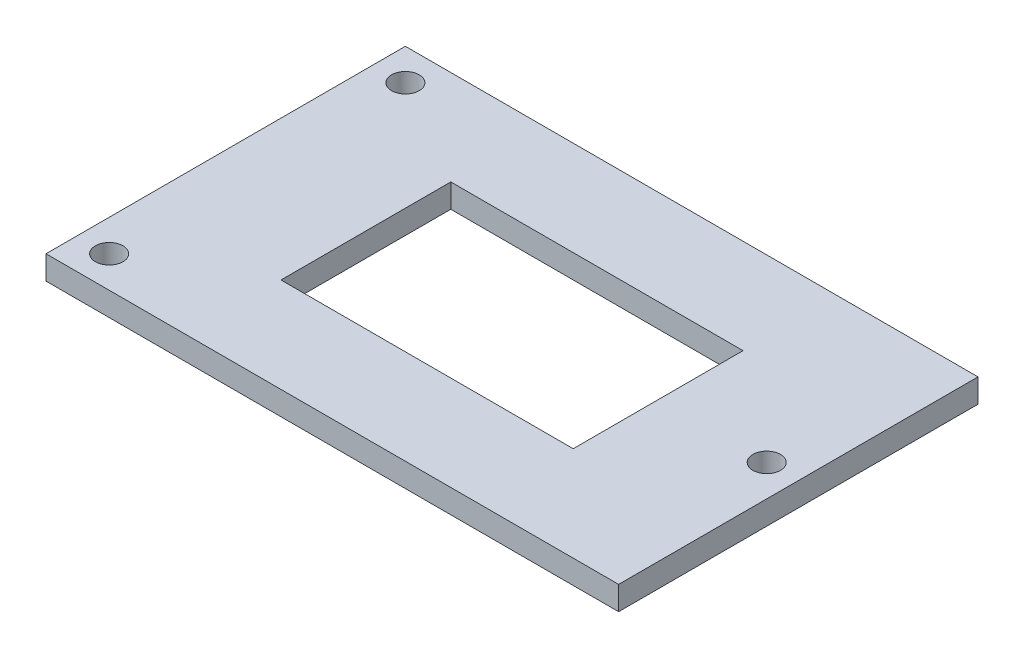
ISO-10303-21;
HEADER;
FILE_DESCRIPTION(('STEP AP214'),'2;1');
FILE_NAME('part.step','',(''),(''),'','','');
FILE_SCHEMA(('AUTOMOTIVE_DESIGN { 1 0 10303 214 1 1 1 1 }'));
ENDSEC;
DATA;
#1=APPLICATION_CONTEXT('core data for automotive mechanical design processes');
#2=APPLICATION_PROTOCOL_DEFINITION('international standard','automotive_design',2000,#1);
#3=PRODUCT_CONTEXT('',#1,'mechanical');
#4=PRODUCT('Part','Part','',(#3));
#5=PRODUCT_RELATED_PRODUCT_CATEGORY('part','',(#4));
#6=PRODUCT_DEFINITION_FORMATION('','',#4);
#7=PRODUCT_DEFINITION_CONTEXT('part definition',#1,'design');
#8=PRODUCT_DEFINITION('design','',#6,#7);
#9=PRODUCT_DEFINITION_SHAPE('','',#8);
#10=(LENGTH_UNIT() NAMED_UNIT(*) SI_UNIT(.MILLI.,.METRE.));
#11=(NAMED_UNIT(*) PLANE_ANGLE_UNIT() SI_UNIT($,.RADIAN.));
#12=(NAMED_UNIT(*) SI_UNIT($,.STERADIAN.) SOLID_ANGLE_UNIT());
#13=UNCERTAINTY_MEASURE_WITH_UNIT(LENGTH_MEASURE(1.E-05),#10,'distance_accuracy_value','');
#14=(GEOMETRIC_REPRESENTATION_CONTEXT(3) GLOBAL_UNCERTAINTY_ASSIGNED_CONTEXT((#13)) GLOBAL_UNIT_ASSIGNED_CONTEXT((#10,
#11,#12)) REPRESENTATION_CONTEXT('',''));
#15=CARTESIAN_POINT('',(0.,0.,0.));
#16=DIRECTION('',(0.,0.,1.));
#17=DIRECTION('',(1.,0.,0.));
#18=AXIS2_PLACEMENT_3D('',#15,#16,#17);
#19=CARTESIAN_POINT('',(0.,3.,0.));
#20=DIRECTION('',(0.,-1.,0.));
#21=DIRECTION('',(0.,0.,-1.));
#22=AXIS2_PLACEMENT_3D('',#19,#20,#21);
#23=PLANE('',#22);
#24=DIRECTION('',(0.,0.,1.));
#25=VECTOR('',#24,1.);
#26=CARTESIAN_POINT('',(0.,3.,0.));
#27=LINE('',#26,#25);
#28=CARTESIAN_POINT('',(0.,3.,-45.5));
#29=VERTEX_POINT('',#28);
#30=CARTESIAN_POINT('',(0.,3.,0.));
#31=VERTEX_POINT('',#30);
#32=EDGE_CURVE('E142',#29,#31,#27,.T.);
#33=ORIENTED_EDGE('',*,*,#32,.T.);
#34=DIRECTION('',(1.,0.,0.));
#35=VECTOR('',#34,1.);
#36=CARTESIAN_POINT('',(0.,3.,0.));
#37=LINE('',#36,#35);
#38=CARTESIAN_POINT('',(72.5,3.,0.));
#39=VERTEX_POINT('',#38);
#40=EDGE_CURVE('E145',#31,#39,#37,.T.);
#41=ORIENTED_EDGE('',*,*,#40,.T.);
#42=DIRECTION('',(0.,0.,-1.));
#43=VECTOR('',#42,1.);
#44=CARTESIAN_POINT('',(72.5,3.,0.));
#45=LINE('',#44,#43);
#46=CARTESIAN_POINT('',(72.5,3.,-45.5));
#47=VERTEX_POINT('',#46);
#48=EDGE_CURVE('E148',#39,#47,#45,.T.);
#49=ORIENTED_EDGE('',*,*,#48,.T.);
#50=DIRECTION('',(-1.,0.,0.));
#51=VECTOR('',#50,1.);
#52=CARTESIAN_POINT('',(0.,3.,-45.5));
#53=LINE('',#52,#51);
#54=EDGE_CURVE('E150',#47,#29,#53,.T.);
#55=ORIENTED_EDGE('',*,*,#54,.T.);
#56=EDGE_LOOP('',(#33,#41,#49,#55));
#57=FACE_BOUND('',#56,.T.);
#58=DIRECTION('',(0.,0.,1.));
#59=VECTOR('',#58,1.);
#60=CARTESIAN_POINT('',(17.75,3.,-12.));
#61=LINE('',#60,#59);
#62=CARTESIAN_POINT('',(17.75,3.,-33.5));
#63=VERTEX_POINT('',#62);
#64=CARTESIAN_POINT('',(17.75,3.,-12.));
#65=VERTEX_POINT('',#64);
#66=EDGE_CURVE('E103',#63,#65,#61,.T.);
#67=ORIENTED_EDGE('',*,*,#66,.F.);
#68=DIRECTION('',(-1.,0.,0.));
#69=VECTOR('',#68,1.);
#70=CARTESIAN_POINT('',(17.75,3.,-33.5));
#71=LINE('',#70,#69);
#72=CARTESIAN_POINT('',(54.75,3.,-33.5));
#73=VERTEX_POINT('',#72);
#74=EDGE_CURVE('E126',#73,#63,#71,.T.);
#75=ORIENTED_EDGE('',*,*,#74,.F.);
#76=DIRECTION('',(0.,0.,-1.));
#77=VECTOR('',#76,1.);
#78=CARTESIAN_POINT('',(54.75,3.,-12.));
#79=LINE('',#78,#77);
#80=CARTESIAN_POINT('',(54.75,3.,-12.));
#81=VERTEX_POINT('',#80);
#82=EDGE_CURVE('E124',#81,#73,#79,.T.);
#83=ORIENTED_EDGE('',*,*,#82,.F.);
#84=DIRECTION('',(1.,0.,0.));
#85=VECTOR('',#84,1.);
#86=CARTESIAN_POINT('',(17.75,3.,-12.));
#87=LINE('',#86,#85);
#88=EDGE_CURVE('E111',#65,#81,#87,.T.);
#89=ORIENTED_EDGE('',*,*,#88,.F.);
#90=EDGE_LOOP('',(#67,#75,#83,#89));
#91=FACE_BOUND('',#90,.T.);
#92=CARTESIAN_POINT('',(68.5,3.,-22.75));
#93=DIRECTION('',(0.,1.,0.));
#94=DIRECTION('',(0.,0.,1.));
#95=AXIS2_PLACEMENT_3D('',#92,#93,#94);
#96=CIRCLE('',#95,1.75);
#97=CARTESIAN_POINT('',(68.5,3.,-21.));
#98=VERTEX_POINT('',#97);
#99=EDGE_CURVE('E132',#98,#98,#96,.T.);
#100=ORIENTED_EDGE('',*,*,#99,.F.);
#101=EDGE_LOOP('',(#100));
#102=FACE_BOUND('',#101,.T.);
#103=CARTESIAN_POINT('',(4.,3.,-41.5));
#104=DIRECTION('',(0.,1.,0.));
#105=DIRECTION('',(0.,0.,1.));
#106=AXIS2_PLACEMENT_3D('',#103,#104,#105);
#107=CIRCLE('',#106,1.75);
#108=CARTESIAN_POINT('',(4.,3.,-39.75));
#109=VERTEX_POINT('',#108);
#110=EDGE_CURVE('E244',#109,#109,#107,.T.);
#111=ORIENTED_EDGE('',*,*,#110,.F.);
#112=EDGE_LOOP('',(#111));
#113=FACE_BOUND('',#112,.T.);
#114=CARTESIAN_POINT('',(4.,3.,-4.));
#115=DIRECTION('',(0.,1.,0.));
#116=DIRECTION('',(0.,0.,1.));
#117=AXIS2_PLACEMENT_3D('',#114,#115,#116);
#118=CIRCLE('',#117,1.75);
#119=CARTESIAN_POINT('',(4.,3.,-2.25));
#120=VERTEX_POINT('',#119);
#121=EDGE_CURVE('E235',#120,#120,#118,.T.);
#122=ORIENTED_EDGE('',*,*,#121,.F.);
#123=EDGE_LOOP('',(#122));
#124=FACE_BOUND('',#123,.T.);
#125=ADVANCED_FACE('F38',(#57,#91,#102,#113,#124),#23,.F.);
#126=CARTESIAN_POINT('',(0.,0.,0.));
#127=DIRECTION('',(0.,-1.,0.));
#128=DIRECTION('',(0.,0.,-1.));
#129=AXIS2_PLACEMENT_3D('',#126,#127,#128);
#130=PLANE('',#129);
#131=CARTESIAN_POINT('',(4.,0.,-41.5));
#132=DIRECTION('',(0.,1.,0.));
#133=DIRECTION('',(0.,0.,1.));
#134=AXIS2_PLACEMENT_3D('',#131,#132,#133);
#135=CIRCLE('',#134,1.75);
#136=CARTESIAN_POINT('',(4.,0.,-39.75));
#137=VERTEX_POINT('',#136);
#138=EDGE_CURVE('E241',#137,#137,#135,.T.);
#139=ORIENTED_EDGE('',*,*,#138,.T.);
#140=EDGE_LOOP('',(#139));
#141=FACE_BOUND('',#140,.T.);
#142=DIRECTION('',(-1.,0.,0.));
#143=VECTOR('',#142,1.);
#144=CARTESIAN_POINT('',(17.75,0.,-33.5));
#145=LINE('',#144,#143);
#146=CARTESIAN_POINT('',(54.75,0.,-33.5));
#147=VERTEX_POINT('',#146);
#148=CARTESIAN_POINT('',(17.75,0.,-33.5));
#149=VERTEX_POINT('',#148);
#150=EDGE_CURVE('E112',#147,#149,#145,.T.);
#151=ORIENTED_EDGE('',*,*,#150,.T.);
#152=DIRECTION('',(0.,0.,1.));
#153=VECTOR('',#152,1.);
#154=CARTESIAN_POINT('',(17.75,0.,-12.));
#155=LINE('',#154,#153);
#156=CARTESIAN_POINT('',(17.75,0.,-12.));
#157=VERTEX_POINT('',#156);
#158=EDGE_CURVE('E61',#149,#157,#155,.T.);
#159=ORIENTED_EDGE('',*,*,#158,.T.);
#160=DIRECTION('',(1.,0.,0.));
#161=VECTOR('',#160,1.);
#162=CARTESIAN_POINT('',(17.75,0.,-12.));
#163=LINE('',#162,#161);
#164=CARTESIAN_POINT('',(54.75,0.,-12.));
#165=VERTEX_POINT('',#164);
#166=EDGE_CURVE('E118',#157,#165,#163,.T.);
#167=ORIENTED_EDGE('',*,*,#166,.T.);
#168=DIRECTION('',(0.,0.,-1.));
#169=VECTOR('',#168,1.);
#170=CARTESIAN_POINT('',(54.75,0.,-12.));
#171=LINE('',#170,#169);
#172=EDGE_CURVE('E134',#165,#147,#171,.T.);
#173=ORIENTED_EDGE('',*,*,#172,.T.);
#174=EDGE_LOOP('',(#151,#159,#167,#173));
#175=FACE_BOUND('',#174,.T.);
#176=DIRECTION('',(0.,0.,1.));
#177=VECTOR('',#176,1.);
#178=CARTESIAN_POINT('',(0.,0.,0.));
#179=LINE('',#178,#177);
#180=CARTESIAN_POINT('',(0.,0.,-45.5));
#181=VERTEX_POINT('',#180);
#182=CARTESIAN_POINT('',(0.,0.,0.));
#183=VERTEX_POINT('',#182);
#184=EDGE_CURVE('E119',#181,#183,#179,.T.);
#185=ORIENTED_EDGE('',*,*,#184,.F.);
#186=DIRECTION('',(-1.,0.,0.));
#187=VECTOR('',#186,1.);
#188=CARTESIAN_POINT('',(0.,0.,-45.5));
#189=LINE('',#188,#187);
#190=CARTESIAN_POINT('',(72.5,0.,-45.5));
#191=VERTEX_POINT('',#190);
#192=EDGE_CURVE('E146',#191,#181,#189,.T.);
#193=ORIENTED_EDGE('',*,*,#192,.F.);
#194=DIRECTION('',(0.,0.,-1.));
#195=VECTOR('',#194,1.);
#196=CARTESIAN_POINT('',(72.5,0.,0.));
#197=LINE('',#196,#195);
#198=CARTESIAN_POINT('',(72.5,0.,0.));
#199=VERTEX_POINT('',#198);
#200=EDGE_CURVE('E157',#199,#191,#197,.T.);
#201=ORIENTED_EDGE('',*,*,#200,.F.);
#202=DIRECTION('',(1.,0.,0.));
#203=VECTOR('',#202,1.);
#204=CARTESIAN_POINT('',(0.,0.,0.));
#205=LINE('',#204,#203);
#206=EDGE_CURVE('E155',#183,#199,#205,.T.);
#207=ORIENTED_EDGE('',*,*,#206,.F.);
#208=EDGE_LOOP('',(#185,#193,#201,#207));
#209=FACE_BOUND('',#208,.T.);
#210=CARTESIAN_POINT('',(68.5,0.,-22.75));
#211=DIRECTION('',(0.,1.,0.));
#212=DIRECTION('',(0.,0.,1.));
#213=AXIS2_PLACEMENT_3D('',#210,#211,#212);
#214=CIRCLE('',#213,1.75);
#215=CARTESIAN_POINT('',(68.5,0.,-21.));
#216=VERTEX_POINT('',#215);
#217=EDGE_CURVE('E247',#216,#216,#214,.T.);
#218=ORIENTED_EDGE('',*,*,#217,.T.);
#219=EDGE_LOOP('',(#218));
#220=FACE_BOUND('',#219,.T.);
#221=CARTESIAN_POINT('',(4.,0.,-4.));
#222=DIRECTION('',(0.,1.,0.));
#223=DIRECTION('',(0.,0.,1.));
#224=AXIS2_PLACEMENT_3D('',#221,#222,#223);
#225=CIRCLE('',#224,1.75);
#226=CARTESIAN_POINT('',(4.,0.,-2.25));
#227=VERTEX_POINT('',#226);
#228=EDGE_CURVE('E238',#227,#227,#225,.T.);
#229=ORIENTED_EDGE('',*,*,#228,.T.);
#230=EDGE_LOOP('',(#229));
#231=FACE_BOUND('',#230,.T.);
#232=ADVANCED_FACE('F175',(#141,#175,#209,#220,#231),#130,.T.);
#233=CARTESIAN_POINT('',(0.,3.,0.));
#234=DIRECTION('',(1.,0.,0.));
#235=DIRECTION('',(0.,0.,-1.));
#236=AXIS2_PLACEMENT_3D('',#233,#234,#235);
#237=PLANE('',#236);
#238=ORIENTED_EDGE('',*,*,#184,.T.);
#239=DIRECTION('',(0.,-1.,0.));
#240=VECTOR('',#239,1.);
#241=CARTESIAN_POINT('',(0.,3.,0.));
#242=LINE('',#241,#240);
#243=EDGE_CURVE('E11',#31,#183,#242,.T.);
#244=ORIENTED_EDGE('',*,*,#243,.F.);
#245=ORIENTED_EDGE('',*,*,#32,.F.);
#246=DIRECTION('',(0.,-1.,0.));
#247=VECTOR('',#246,1.);
#248=CARTESIAN_POINT('',(0.,3.,-45.5));
#249=LINE('',#248,#247);
#250=EDGE_CURVE('E152',#29,#181,#249,.T.);
#251=ORIENTED_EDGE('',*,*,#250,.T.);
#252=EDGE_LOOP('',(#238,#244,#245,#251));
#253=FACE_BOUND('',#252,.T.);
#254=ADVANCED_FACE('F40',(#253),#237,.F.);
#255=CARTESIAN_POINT('',(0.,3.,0.));
#256=DIRECTION('',(0.,0.,-1.));
#257=DIRECTION('',(-1.,0.,0.));
#258=AXIS2_PLACEMENT_3D('',#255,#256,#257);
#259=PLANE('',#258);
#260=ORIENTED_EDGE('',*,*,#206,.T.);
#261=DIRECTION('',(0.,-1.,0.));
#262=VECTOR('',#261,1.);
#263=CARTESIAN_POINT('',(72.5,3.,0.));
#264=LINE('',#263,#262);
#265=EDGE_CURVE('E46',#39,#199,#264,.T.);
#266=ORIENTED_EDGE('',*,*,#265,.F.);
#267=ORIENTED_EDGE('',*,*,#40,.F.);
#268=ORIENTED_EDGE('',*,*,#243,.T.);
#269=EDGE_LOOP('',(#260,#266,#267,#268));
#270=FACE_BOUND('',#269,.T.);
#271=ADVANCED_FACE('F185',(#270),#259,.F.);
#272=CARTESIAN_POINT('',(72.5,3.,0.));
#273=DIRECTION('',(-1.,0.,0.));
#274=DIRECTION('',(0.,0.,1.));
#275=AXIS2_PLACEMENT_3D('',#272,#273,#274);
#276=PLANE('',#275);
#277=ORIENTED_EDGE('',*,*,#200,.T.);
#278=DIRECTION('',(0.,-1.,0.));
#279=VECTOR('',#278,1.);
#280=CARTESIAN_POINT('',(72.5,3.,-45.5));
#281=LINE('',#280,#279);
#282=EDGE_CURVE('E162',#47,#191,#281,.T.);
#283=ORIENTED_EDGE('',*,*,#282,.F.);
#284=ORIENTED_EDGE('',*,*,#48,.F.);
#285=ORIENTED_EDGE('',*,*,#265,.T.);
#286=EDGE_LOOP('',(#277,#283,#284,#285));
#287=FACE_BOUND('',#286,.T.);
#288=ADVANCED_FACE('F169',(#287),#276,.F.);
#289=CARTESIAN_POINT('',(0.,3.,-45.5));
#290=DIRECTION('',(0.,0.,1.));
#291=DIRECTION('',(1.,0.,0.));
#292=AXIS2_PLACEMENT_3D('',#289,#290,#291);
#293=PLANE('',#292);
#294=ORIENTED_EDGE('',*,*,#192,.T.);
#295=ORIENTED_EDGE('',*,*,#250,.F.);
#296=ORIENTED_EDGE('',*,*,#54,.F.);
#297=ORIENTED_EDGE('',*,*,#282,.T.);
#298=EDGE_LOOP('',(#294,#295,#296,#297));
#299=FACE_BOUND('',#298,.T.);
#300=ADVANCED_FACE('F179',(#299),#293,.F.);
#301=CARTESIAN_POINT('',(17.75,3.,-12.));
#302=DIRECTION('',(1.,0.,0.));
#303=DIRECTION('',(0.,0.,-1.));
#304=AXIS2_PLACEMENT_3D('',#301,#302,#303);
#305=PLANE('',#304);
#306=ORIENTED_EDGE('',*,*,#158,.F.);
#307=DIRECTION('',(0.,-1.,0.));
#308=VECTOR('',#307,1.);
#309=CARTESIAN_POINT('',(17.75,3.,-33.5));
#310=LINE('',#309,#308);
#311=EDGE_CURVE('E107',#63,#149,#310,.T.);
#312=ORIENTED_EDGE('',*,*,#311,.F.);
#313=ORIENTED_EDGE('',*,*,#66,.T.);
#314=DIRECTION('',(0.,-1.,0.));
#315=VECTOR('',#314,1.);
#316=CARTESIAN_POINT('',(17.75,3.,-12.));
#317=LINE('',#316,#315);
#318=EDGE_CURVE('E106',#65,#157,#317,.T.);
#319=ORIENTED_EDGE('',*,*,#318,.T.);
#320=EDGE_LOOP('',(#306,#312,#313,#319));
#321=FACE_BOUND('',#320,.T.);
#322=ADVANCED_FACE('F105',(#321),#305,.T.);
#323=CARTESIAN_POINT('',(17.75,3.,-12.));
#324=DIRECTION('',(0.,0.,-1.));
#325=DIRECTION('',(-1.,0.,0.));
#326=AXIS2_PLACEMENT_3D('',#323,#324,#325);
#327=PLANE('',#326);
#328=ORIENTED_EDGE('',*,*,#166,.F.);
#329=ORIENTED_EDGE('',*,*,#318,.F.);
#330=ORIENTED_EDGE('',*,*,#88,.T.);
#331=DIRECTION('',(0.,-1.,0.));
#332=VECTOR('',#331,1.);
#333=CARTESIAN_POINT('',(54.75,3.,-12.));
#334=LINE('',#333,#332);
#335=EDGE_CURVE('E120',#81,#165,#334,.T.);
#336=ORIENTED_EDGE('',*,*,#335,.T.);
#337=EDGE_LOOP('',(#328,#329,#330,#336));
#338=FACE_BOUND('',#337,.T.);
#339=ADVANCED_FACE('F115',(#338),#327,.T.);
#340=CARTESIAN_POINT('',(54.75,3.,-12.));
#341=DIRECTION('',(-1.,0.,0.));
#342=DIRECTION('',(0.,0.,1.));
#343=AXIS2_PLACEMENT_3D('',#340,#341,#342);
#344=PLANE('',#343);
#345=ORIENTED_EDGE('',*,*,#172,.F.);
#346=ORIENTED_EDGE('',*,*,#335,.F.);
#347=ORIENTED_EDGE('',*,*,#82,.T.);
#348=DIRECTION('',(0.,-1.,0.));
#349=VECTOR('',#348,1.);
#350=CARTESIAN_POINT('',(54.75,3.,-33.5));
#351=LINE('',#350,#349);
#352=EDGE_CURVE('E53',#73,#147,#351,.T.);
#353=ORIENTED_EDGE('',*,*,#352,.T.);
#354=EDGE_LOOP('',(#345,#346,#347,#353));
#355=FACE_BOUND('',#354,.T.);
#356=ADVANCED_FACE('F209',(#355),#344,.T.);
#357=CARTESIAN_POINT('',(17.75,3.,-33.5));
#358=DIRECTION('',(0.,0.,1.));
#359=DIRECTION('',(1.,0.,0.));
#360=AXIS2_PLACEMENT_3D('',#357,#358,#359);
#361=PLANE('',#360);
#362=ORIENTED_EDGE('',*,*,#150,.F.);
#363=ORIENTED_EDGE('',*,*,#352,.F.);
#364=ORIENTED_EDGE('',*,*,#74,.T.);
#365=ORIENTED_EDGE('',*,*,#311,.T.);
#366=EDGE_LOOP('',(#362,#363,#364,#365));
#367=FACE_BOUND('',#366,.T.);
#368=ADVANCED_FACE('F213',(#367),#361,.T.);
#369=CARTESIAN_POINT('',(68.5,3.,-22.75));
#370=DIRECTION('',(0.,-1.,0.));
#371=DIRECTION('',(0.,0.,-1.));
#372=AXIS2_PLACEMENT_3D('',#369,#370,#371);
#373=CYLINDRICAL_SURFACE('',#372,1.75);
#374=ORIENTED_EDGE('',*,*,#99,.T.);
#375=EDGE_LOOP('',(#374));
#376=FACE_BOUND('',#375,.T.);
#377=ORIENTED_EDGE('',*,*,#217,.F.);
#378=EDGE_LOOP('',(#377));
#379=FACE_BOUND('',#378,.T.);
#380=ADVANCED_FACE('F219',(#376,#379),#373,.F.);
#381=CARTESIAN_POINT('',(4.,3.,-41.5));
#382=DIRECTION('',(0.,-1.,0.));
#383=DIRECTION('',(0.,0.,-1.));
#384=AXIS2_PLACEMENT_3D('',#381,#382,#383);
#385=CYLINDRICAL_SURFACE('',#384,1.75);
#386=ORIENTED_EDGE('',*,*,#110,.T.);
#387=EDGE_LOOP('',(#386));
#388=FACE_BOUND('',#387,.T.);
#389=ORIENTED_EDGE('',*,*,#138,.F.);
#390=EDGE_LOOP('',(#389));
#391=FACE_BOUND('',#390,.T.);
#392=ADVANCED_FACE('F222',(#388,#391),#385,.F.);
#393=CARTESIAN_POINT('',(4.,3.,-4.));
#394=DIRECTION('',(0.,-1.,0.));
#395=DIRECTION('',(0.,0.,-1.));
#396=AXIS2_PLACEMENT_3D('',#393,#394,#395);
#397=CYLINDRICAL_SURFACE('',#396,1.75);
#398=ORIENTED_EDGE('',*,*,#121,.T.);
#399=EDGE_LOOP('',(#398));
#400=FACE_BOUND('',#399,.T.);
#401=ORIENTED_EDGE('',*,*,#228,.F.);
#402=EDGE_LOOP('',(#401));
#403=FACE_BOUND('',#402,.T.);
#404=ADVANCED_FACE('F226',(#400,#403),#397,.F.);
#405=CLOSED_SHELL('',(#125,#232,#254,#271,#288,#300,#322,#339,#356,#368,#380,#392,#404));
#406=MANIFOLD_SOLID_BREP('B2',#405);
#407=ADVANCED_BREP_SHAPE_REPRESENTATION('',(#18,#406),#14);
#408=SHAPE_DEFINITION_REPRESENTATION(#9,#407);
ENDSEC;
END-ISO-10303-21;
